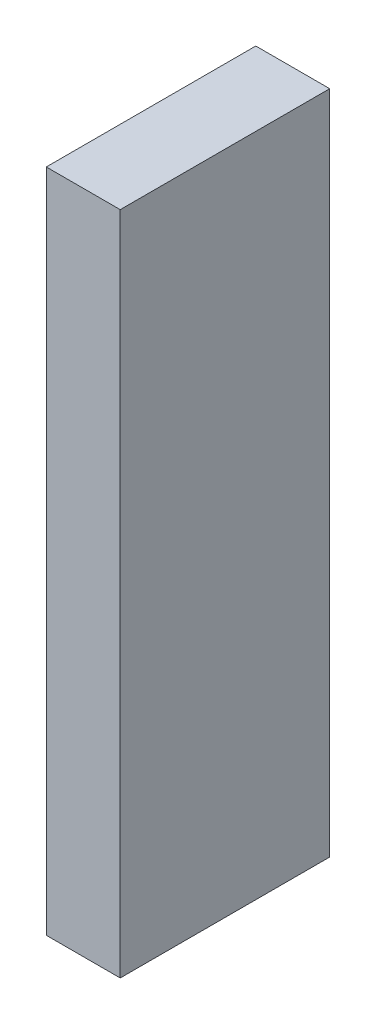
ISO-10303-21;
HEADER;
FILE_DESCRIPTION(('STEP AP214'),'2;1');
FILE_NAME('part.step','',(''),(''),'','','');
FILE_SCHEMA(('AUTOMOTIVE_DESIGN { 1 0 10303 214 1 1 1 1 }'));
ENDSEC;
DATA;
#1=APPLICATION_CONTEXT('core data for automotive mechanical design processes');
#2=APPLICATION_PROTOCOL_DEFINITION('international standard','automotive_design',2000,#1);
#3=PRODUCT_CONTEXT('',#1,'mechanical');
#4=PRODUCT('Part','Part','',(#3));
#5=PRODUCT_RELATED_PRODUCT_CATEGORY('part','',(#4));
#6=PRODUCT_DEFINITION_FORMATION('','',#4);
#7=PRODUCT_DEFINITION_CONTEXT('part definition',#1,'design');
#8=PRODUCT_DEFINITION('design','',#6,#7);
#9=PRODUCT_DEFINITION_SHAPE('','',#8);
#10=(LENGTH_UNIT() NAMED_UNIT(*) SI_UNIT(.MILLI.,.METRE.));
#11=(NAMED_UNIT(*) PLANE_ANGLE_UNIT() SI_UNIT($,.RADIAN.));
#12=(NAMED_UNIT(*) SI_UNIT($,.STERADIAN.) SOLID_ANGLE_UNIT());
#13=UNCERTAINTY_MEASURE_WITH_UNIT(LENGTH_MEASURE(1.E-05),#10,'distance_accuracy_value','');
#14=(GEOMETRIC_REPRESENTATION_CONTEXT(3) GLOBAL_UNCERTAINTY_ASSIGNED_CONTEXT((#13)) GLOBAL_UNIT_ASSIGNED_CONTEXT((#10,
#11,#12)) REPRESENTATION_CONTEXT('',''));
#15=CARTESIAN_POINT('',(0.,0.,0.));
#16=DIRECTION('',(0.,0.,1.));
#17=DIRECTION('',(1.,0.,0.));
#18=AXIS2_PLACEMENT_3D('',#15,#16,#17);
#19=CARTESIAN_POINT('',(2.4500059016635,2.69999824077003,0.));
#20=DIRECTION('',(-1.,8.74227765734759E-08,0.));
#21=DIRECTION('',(-8.74227765734759E-08,-1.,0.));
#22=AXIS2_PLACEMENT_3D('',#19,#20,#21);
#23=PLANE('',#22);
#24=DIRECTION('',(-8.74227765512293E-08,-0.999999999999996,0.));
#25=VECTOR('',#24,1.);
#26=CARTESIAN_POINT('',(2.4500059016635,2.69999824077003,0.));
#27=LINE('',#26,#25);
#28=CARTESIAN_POINT('',(2.4500059016635,2.69999824077003,0.));
#29=VERTEX_POINT('',#28);
#30=CARTESIAN_POINT('',(2.45000542958104,-2.69999565571435,0.));
#31=VERTEX_POINT('',#30);
#32=EDGE_CURVE('E11',#29,#31,#27,.T.);
#33=ORIENTED_EDGE('',*,*,#32,.T.);
#34=DIRECTION('',(0.,0.,1.));
#35=VECTOR('',#34,1.);
#36=CARTESIAN_POINT('',(2.45000542958104,-2.69999565571435,0.));
#37=LINE('',#36,#35);
#38=CARTESIAN_POINT('',(2.45000542958104,-2.69999565571435,1.6999990940094));
#39=VERTEX_POINT('',#38);
#40=EDGE_CURVE('E88',#31,#39,#37,.T.);
#41=ORIENTED_EDGE('',*,*,#40,.T.);
#42=DIRECTION('',(-8.74227765512293E-08,-0.999999999999996,0.));
#43=VECTOR('',#42,1.);
#44=CARTESIAN_POINT('',(2.4500059016635,2.69999824077003,1.6999990940094));
#45=LINE('',#44,#43);
#46=CARTESIAN_POINT('',(2.4500059016635,2.69999824077003,1.6999990940094));
#47=VERTEX_POINT('',#46);
#48=EDGE_CURVE('E83',#47,#39,#45,.T.);
#49=ORIENTED_EDGE('',*,*,#48,.F.);
#50=DIRECTION('',(0.,0.,1.));
#51=VECTOR('',#50,1.);
#52=CARTESIAN_POINT('',(2.4500059016635,2.69999824077003,0.));
#53=LINE('',#52,#51);
#54=EDGE_CURVE('E72',#29,#47,#53,.T.);
#55=ORIENTED_EDGE('',*,*,#54,.F.);
#56=EDGE_LOOP('',(#33,#41,#49,#55));
#57=FACE_BOUND('',#56,.T.);
#58=ADVANCED_FACE('F17',(#57),#23,.T.);
#59=CARTESIAN_POINT('',(2.45000542958104,-2.69999565571435,0.));
#60=DIRECTION('',(-8.74227765734759E-08,-1.,0.));
#61=DIRECTION('',(1.,-8.74227765734759E-08,0.));
#62=AXIS2_PLACEMENT_3D('',#59,#60,#61);
#63=PLANE('',#62);
#64=DIRECTION('',(0.999999999999996,-8.74227766432269E-08,0.));
#65=VECTOR('',#64,1.);
#66=CARTESIAN_POINT('',(2.45000542958104,-2.69999565571435,0.));
#67=LINE('',#66,#65);
#68=CARTESIAN_POINT('',(3.0499962743076,-2.69999570816721,0.));
#69=VERTEX_POINT('',#68);
#70=EDGE_CURVE('E24',#31,#69,#67,.T.);
#71=ORIENTED_EDGE('',*,*,#70,.T.);
#72=DIRECTION('',(0.,0.,1.));
#73=VECTOR('',#72,1.);
#74=CARTESIAN_POINT('',(3.0499962743076,-2.69999570816721,0.));
#75=LINE('',#74,#73);
#76=CARTESIAN_POINT('',(3.0499962743076,-2.69999570816721,1.6999990940094));
#77=VERTEX_POINT('',#76);
#78=EDGE_CURVE('E85',#69,#77,#75,.T.);
#79=ORIENTED_EDGE('',*,*,#78,.T.);
#80=DIRECTION('',(0.999999999999996,-8.74227766432269E-08,0.));
#81=VECTOR('',#80,1.);
#82=CARTESIAN_POINT('',(2.45000542958104,-2.69999565571435,1.6999990940094));
#83=LINE('',#82,#81);
#84=EDGE_CURVE('E66',#39,#77,#83,.T.);
#85=ORIENTED_EDGE('',*,*,#84,.F.);
#86=ORIENTED_EDGE('',*,*,#40,.F.);
#87=EDGE_LOOP('',(#71,#79,#85,#86));
#88=FACE_BOUND('',#87,.T.);
#89=ADVANCED_FACE('F89',(#88),#63,.T.);
#90=CARTESIAN_POINT('',(3.0499962743076,-2.69999570816721,0.));
#91=DIRECTION('',(1.,-8.74227765734759E-08,0.));
#92=DIRECTION('',(8.74227765734759E-08,1.,0.));
#93=AXIS2_PLACEMENT_3D('',#90,#91,#92);
#94=PLANE('',#93);
#95=DIRECTION('',(8.74227765512293E-08,0.999999999999996,0.));
#96=VECTOR('',#95,1.);
#97=CARTESIAN_POINT('',(3.0499962743076,-2.69999570816721,0.));
#98=LINE('',#97,#96);
#99=CARTESIAN_POINT('',(3.04999674639006,2.69999818831717,0.));
#100=VERTEX_POINT('',#99);
#101=EDGE_CURVE('E62',#69,#100,#98,.T.);
#102=ORIENTED_EDGE('',*,*,#101,.T.);
#103=DIRECTION('',(0.,0.,1.));
#104=VECTOR('',#103,1.);
#105=CARTESIAN_POINT('',(3.04999674639006,2.69999818831717,0.));
#106=LINE('',#105,#104);
#107=CARTESIAN_POINT('',(3.04999674639006,2.69999818831717,1.6999990940094));
#108=VERTEX_POINT('',#107);
#109=EDGE_CURVE('E55',#100,#108,#106,.T.);
#110=ORIENTED_EDGE('',*,*,#109,.T.);
#111=DIRECTION('',(8.74227765512293E-08,0.999999999999996,0.));
#112=VECTOR('',#111,1.);
#113=CARTESIAN_POINT('',(3.0499962743076,-2.69999570816721,1.6999990940094));
#114=LINE('',#113,#112);
#115=EDGE_CURVE('E59',#77,#108,#114,.T.);
#116=ORIENTED_EDGE('',*,*,#115,.F.);
#117=ORIENTED_EDGE('',*,*,#78,.F.);
#118=EDGE_LOOP('',(#102,#110,#116,#117));
#119=FACE_BOUND('',#118,.T.);
#120=ADVANCED_FACE('F57',(#119),#94,.T.);
#121=CARTESIAN_POINT('',(3.04999674639006,2.69999818831717,0.));
#122=DIRECTION('',(8.74227765734759E-08,1.,0.));
#123=DIRECTION('',(-1.,8.74227765734759E-08,0.));
#124=AXIS2_PLACEMENT_3D('',#121,#122,#123);
#125=PLANE('',#124);
#126=DIRECTION('',(-0.999999999999996,8.74227766432269E-08,0.));
#127=VECTOR('',#126,1.);
#128=CARTESIAN_POINT('',(3.04999674639006,2.69999818831717,0.));
#129=LINE('',#128,#127);
#130=EDGE_CURVE('E65',#100,#29,#129,.T.);
#131=ORIENTED_EDGE('',*,*,#130,.T.);
#132=ORIENTED_EDGE('',*,*,#54,.T.);
#133=DIRECTION('',(-0.999999999999996,8.74227766432269E-08,0.));
#134=VECTOR('',#133,1.);
#135=CARTESIAN_POINT('',(3.04999674639006,2.69999818831717,1.6999990940094));
#136=LINE('',#135,#134);
#137=EDGE_CURVE('E70',#108,#47,#136,.T.);
#138=ORIENTED_EDGE('',*,*,#137,.F.);
#139=ORIENTED_EDGE('',*,*,#109,.F.);
#140=EDGE_LOOP('',(#131,#132,#138,#139));
#141=FACE_BOUND('',#140,.T.);
#142=ADVANCED_FACE('F71',(#141),#125,.T.);
#143=CARTESIAN_POINT('',(191.775009155273,74.8249816894531,1.6999990940094));
#144=DIRECTION('',(0.,0.,1.));
#145=DIRECTION('',(-1.,8.74227765734759E-08,0.));
#146=AXIS2_PLACEMENT_3D('',#143,#144,#145);
#147=PLANE('',#146);
#148=ORIENTED_EDGE('',*,*,#48,.T.);
#149=ORIENTED_EDGE('',*,*,#84,.T.);
#150=ORIENTED_EDGE('',*,*,#115,.T.);
#151=ORIENTED_EDGE('',*,*,#137,.T.);
#152=EDGE_LOOP('',(#148,#149,#150,#151));
#153=FACE_BOUND('',#152,.T.);
#154=ADVANCED_FACE('F76',(#153),#147,.T.);
#155=CARTESIAN_POINT('',(191.775009155273,74.8249816894531,0.));
#156=DIRECTION('',(0.,0.,1.));
#157=DIRECTION('',(-1.,8.74227765734759E-08,0.));
#158=AXIS2_PLACEMENT_3D('',#155,#156,#157);
#159=PLANE('',#158);
#160=ORIENTED_EDGE('',*,*,#130,.F.);
#161=ORIENTED_EDGE('',*,*,#101,.F.);
#162=ORIENTED_EDGE('',*,*,#70,.F.);
#163=ORIENTED_EDGE('',*,*,#32,.F.);
#164=EDGE_LOOP('',(#160,#161,#162,#163));
#165=FACE_BOUND('',#164,.T.);
#166=ADVANCED_FACE('F91',(#165),#159,.F.);
#167=CLOSED_SHELL('',(#58,#89,#120,#142,#154,#166));
#168=MANIFOLD_SOLID_BREP('B1',#167);
#169=ADVANCED_BREP_SHAPE_REPRESENTATION('',(#18,#168),#14);
#170=SHAPE_DEFINITION_REPRESENTATION(#9,#169);
ENDSEC;
END-ISO-10303-21;
